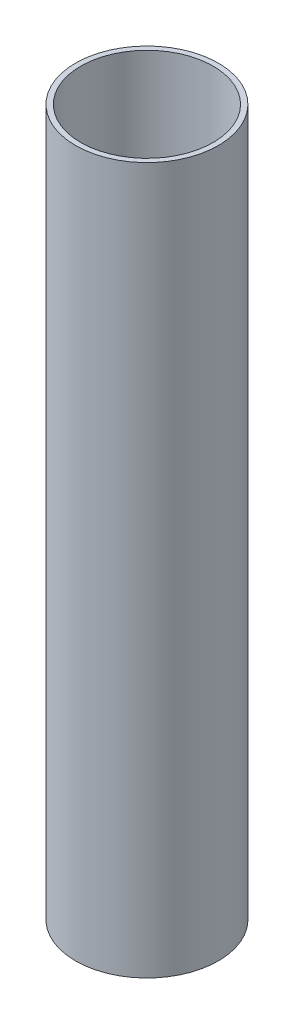
ISO-10303-21;
HEADER;
FILE_DESCRIPTION(('STEP AP214'),'2;1');
FILE_NAME('part.step','',(''),(''),'','','');
FILE_SCHEMA(('AUTOMOTIVE_DESIGN { 1 0 10303 214 1 1 1 1 }'));
ENDSEC;
DATA;
#1=APPLICATION_CONTEXT('core data for automotive mechanical design processes');
#2=APPLICATION_PROTOCOL_DEFINITION('international standard','automotive_design',2000,#1);
#3=PRODUCT_CONTEXT('',#1,'mechanical');
#4=PRODUCT('Part','Part','',(#3));
#5=PRODUCT_RELATED_PRODUCT_CATEGORY('part','',(#4));
#6=PRODUCT_DEFINITION_FORMATION('','',#4);
#7=PRODUCT_DEFINITION_CONTEXT('part definition',#1,'design');
#8=PRODUCT_DEFINITION('design','',#6,#7);
#9=PRODUCT_DEFINITION_SHAPE('','',#8);
#10=(LENGTH_UNIT() NAMED_UNIT(*) SI_UNIT(.MILLI.,.METRE.));
#11=(NAMED_UNIT(*) PLANE_ANGLE_UNIT() SI_UNIT($,.RADIAN.));
#12=(NAMED_UNIT(*) SI_UNIT($,.STERADIAN.) SOLID_ANGLE_UNIT());
#13=UNCERTAINTY_MEASURE_WITH_UNIT(LENGTH_MEASURE(1.E-05),#10,'distance_accuracy_value','');
#14=(GEOMETRIC_REPRESENTATION_CONTEXT(3) GLOBAL_UNCERTAINTY_ASSIGNED_CONTEXT((#13)) GLOBAL_UNIT_ASSIGNED_CONTEXT((#10,
#11,#12)) REPRESENTATION_CONTEXT('',''));
#15=CARTESIAN_POINT('',(0.,0.,0.));
#16=DIRECTION('',(0.,0.,1.));
#17=DIRECTION('',(1.,0.,0.));
#18=AXIS2_PLACEMENT_3D('',#15,#16,#17);
#19=CARTESIAN_POINT('',(0.,406.4,0.));
#20=DIRECTION('',(0.,1.,0.));
#21=DIRECTION('',(0.,0.,1.));
#22=AXIS2_PLACEMENT_3D('',#19,#20,#21);
#23=PLANE('',#22);
#24=CARTESIAN_POINT('',(0.,406.4,0.));
#25=DIRECTION('',(0.,1.,0.));
#26=DIRECTION('',(0.,0.,1.));
#27=AXIS2_PLACEMENT_3D('',#24,#25,#26);
#28=CIRCLE('',#27,41.099994);
#29=CARTESIAN_POINT('',(0.,406.4,41.099994));
#30=VERTEX_POINT('',#29);
#31=EDGE_CURVE('E10',#30,#30,#28,.T.);
#32=ORIENTED_EDGE('',*,*,#31,.T.);
#33=EDGE_LOOP('',(#32));
#34=FACE_BOUND('',#33,.T.);
#35=CARTESIAN_POINT('',(0.,406.4,0.));
#36=DIRECTION('',(0.,1.,0.));
#37=DIRECTION('',(0.,0.,1.));
#38=AXIS2_PLACEMENT_3D('',#35,#36,#37);
#39=CIRCLE('',#38,38.1);
#40=CARTESIAN_POINT('',(0.,406.4,38.1));
#41=VERTEX_POINT('',#40);
#42=EDGE_CURVE('E42',#41,#41,#39,.T.);
#43=ORIENTED_EDGE('',*,*,#42,.F.);
#44=EDGE_LOOP('',(#43));
#45=FACE_BOUND('',#44,.T.);
#46=ADVANCED_FACE('F31',(#34,#45),#23,.T.);
#47=CARTESIAN_POINT('',(0.,0.,0.));
#48=DIRECTION('',(0.,1.,0.));
#49=DIRECTION('',(0.,0.,1.));
#50=AXIS2_PLACEMENT_3D('',#47,#48,#49);
#51=PLANE('',#50);
#52=CARTESIAN_POINT('',(0.,0.,0.));
#53=DIRECTION('',(0.,1.,0.));
#54=DIRECTION('',(0.,0.,1.));
#55=AXIS2_PLACEMENT_3D('',#52,#53,#54);
#56=CIRCLE('',#55,41.099994);
#57=CARTESIAN_POINT('',(0.,0.,41.099994));
#58=VERTEX_POINT('',#57);
#59=EDGE_CURVE('E35',#58,#58,#56,.T.);
#60=ORIENTED_EDGE('',*,*,#59,.F.);
#61=EDGE_LOOP('',(#60));
#62=FACE_BOUND('',#61,.T.);
#63=CARTESIAN_POINT('',(0.,0.,0.));
#64=DIRECTION('',(0.,1.,0.));
#65=DIRECTION('',(0.,0.,1.));
#66=AXIS2_PLACEMENT_3D('',#63,#64,#65);
#67=CIRCLE('',#66,38.1);
#68=CARTESIAN_POINT('',(0.,0.,38.1));
#69=VERTEX_POINT('',#68);
#70=EDGE_CURVE('E44',#69,#69,#67,.T.);
#71=ORIENTED_EDGE('',*,*,#70,.T.);
#72=EDGE_LOOP('',(#71));
#73=FACE_BOUND('',#72,.T.);
#74=ADVANCED_FACE('F54',(#62,#73),#51,.F.);
#75=CARTESIAN_POINT('',(0.,406.4,0.));
#76=DIRECTION('',(0.,-1.,0.));
#77=DIRECTION('',(0.,0.,-1.));
#78=AXIS2_PLACEMENT_3D('',#75,#76,#77);
#79=CYLINDRICAL_SURFACE('',#78,41.099994);
#80=ORIENTED_EDGE('',*,*,#31,.F.);
#81=EDGE_LOOP('',(#80));
#82=FACE_BOUND('',#81,.T.);
#83=ORIENTED_EDGE('',*,*,#59,.T.);
#84=EDGE_LOOP('',(#83));
#85=FACE_BOUND('',#84,.T.);
#86=ADVANCED_FACE('F33',(#82,#85),#79,.T.);
#87=CARTESIAN_POINT('',(0.,406.4,0.));
#88=DIRECTION('',(0.,-1.,0.));
#89=DIRECTION('',(0.,0.,-1.));
#90=AXIS2_PLACEMENT_3D('',#87,#88,#89);
#91=CYLINDRICAL_SURFACE('',#90,38.1);
#92=ORIENTED_EDGE('',*,*,#42,.T.);
#93=EDGE_LOOP('',(#92));
#94=FACE_BOUND('',#93,.T.);
#95=ORIENTED_EDGE('',*,*,#70,.F.);
#96=EDGE_LOOP('',(#95));
#97=FACE_BOUND('',#96,.T.);
#98=ADVANCED_FACE('F50',(#94,#97),#91,.F.);
#99=CLOSED_SHELL('',(#46,#74,#86,#98));
#100=MANIFOLD_SOLID_BREP('B2',#99);
#101=ADVANCED_BREP_SHAPE_REPRESENTATION('',(#18,#100),#14);
#102=SHAPE_DEFINITION_REPRESENTATION(#9,#101);
ENDSEC;
END-ISO-10303-21;
